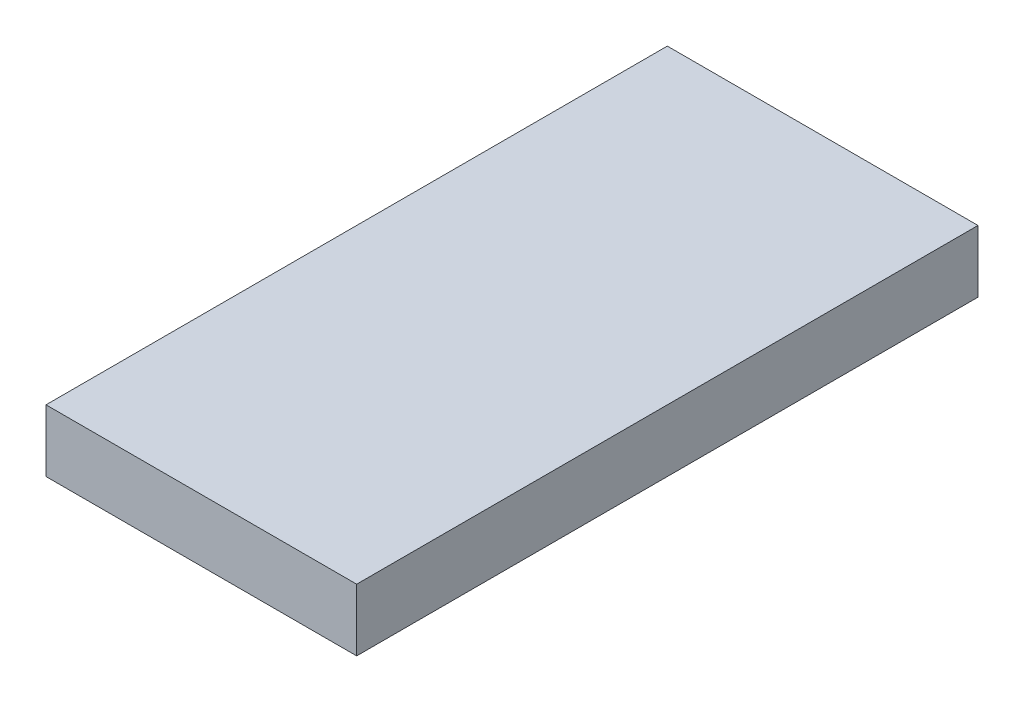
ISO-10303-21;
HEADER;
FILE_DESCRIPTION(('STEP AP214'),'2;1');
FILE_NAME('part.step','',(''),(''),'','','');
FILE_SCHEMA(('AUTOMOTIVE_DESIGN { 1 0 10303 214 1 1 1 1 }'));
ENDSEC;
DATA;
#1=APPLICATION_CONTEXT('core data for automotive mechanical design processes');
#2=APPLICATION_PROTOCOL_DEFINITION('international standard','automotive_design',2000,#1);
#3=PRODUCT_CONTEXT('',#1,'mechanical');
#4=PRODUCT('Part','Part','',(#3));
#5=PRODUCT_RELATED_PRODUCT_CATEGORY('part','',(#4));
#6=PRODUCT_DEFINITION_FORMATION('','',#4);
#7=PRODUCT_DEFINITION_CONTEXT('part definition',#1,'design');
#8=PRODUCT_DEFINITION('design','',#6,#7);
#9=PRODUCT_DEFINITION_SHAPE('','',#8);
#10=(LENGTH_UNIT() NAMED_UNIT(*) SI_UNIT(.MILLI.,.METRE.));
#11=(NAMED_UNIT(*) PLANE_ANGLE_UNIT() SI_UNIT($,.RADIAN.));
#12=(NAMED_UNIT(*) SI_UNIT($,.STERADIAN.) SOLID_ANGLE_UNIT());
#13=UNCERTAINTY_MEASURE_WITH_UNIT(LENGTH_MEASURE(1.E-05),#10,'distance_accuracy_value','');
#14=(GEOMETRIC_REPRESENTATION_CONTEXT(3) GLOBAL_UNCERTAINTY_ASSIGNED_CONTEXT((#13)) GLOBAL_UNIT_ASSIGNED_CONTEXT((#10,
#11,#12)) REPRESENTATION_CONTEXT('',''));
#15=CARTESIAN_POINT('',(0.,0.,0.));
#16=DIRECTION('',(0.,0.,1.));
#17=DIRECTION('',(1.,0.,0.));
#18=AXIS2_PLACEMENT_3D('',#15,#16,#17);
#19=CARTESIAN_POINT('',(-0.486903462864793,0.875068692947304,10.));
#20=DIRECTION('',(1.,0.,0.));
#21=DIRECTION('',(0.,1.,0.));
#22=AXIS2_PLACEMENT_3D('',#19,#20,#21);
#23=PLANE('',#22);
#24=DIRECTION('',(0.,-1.,0.));
#25=VECTOR('',#24,1.);
#26=CARTESIAN_POINT('',(-0.486903462864793,0.875068692947304,0.));
#27=LINE('',#26,#25);
#28=CARTESIAN_POINT('',(-0.486903462864793,0.875068692947304,0.));
#29=VERTEX_POINT('',#28);
#30=CARTESIAN_POINT('',(-0.486903462864793,-0.124931307052696,0.));
#31=VERTEX_POINT('',#30);
#32=EDGE_CURVE('E96',#29,#31,#27,.T.);
#33=ORIENTED_EDGE('',*,*,#32,.T.);
#34=DIRECTION('',(0.,0.,-1.));
#35=VECTOR('',#34,1.);
#36=CARTESIAN_POINT('',(-0.486903462864793,-0.124931307052696,10.));
#37=LINE('',#36,#35);
#38=CARTESIAN_POINT('',(-0.486903462864793,-0.124931307052696,10.));
#39=VERTEX_POINT('',#38);
#40=EDGE_CURVE('E11',#39,#31,#37,.T.);
#41=ORIENTED_EDGE('',*,*,#40,.F.);
#42=DIRECTION('',(0.,-1.,0.));
#43=VECTOR('',#42,1.);
#44=CARTESIAN_POINT('',(-0.486903462864793,0.875068692947304,10.));
#45=LINE('',#44,#43);
#46=CARTESIAN_POINT('',(-0.486903462864793,0.875068692947304,10.));
#47=VERTEX_POINT('',#46);
#48=EDGE_CURVE('E84',#47,#39,#45,.T.);
#49=ORIENTED_EDGE('',*,*,#48,.F.);
#50=DIRECTION('',(0.,0.,-1.));
#51=VECTOR('',#50,1.);
#52=CARTESIAN_POINT('',(-0.486903462864793,0.875068692947304,10.));
#53=LINE('',#52,#51);
#54=EDGE_CURVE('E92',#47,#29,#53,.T.);
#55=ORIENTED_EDGE('',*,*,#54,.T.);
#56=EDGE_LOOP('',(#33,#41,#49,#55));
#57=FACE_BOUND('',#56,.T.);
#58=ADVANCED_FACE('F33',(#57),#23,.F.);
#59=CARTESIAN_POINT('',(-0.486903462864793,-0.124931307052696,10.));
#60=DIRECTION('',(0.,1.,0.));
#61=DIRECTION('',(0.,0.,1.));
#62=AXIS2_PLACEMENT_3D('',#59,#60,#61);
#63=PLANE('',#62);
#64=DIRECTION('',(1.,0.,0.));
#65=VECTOR('',#64,1.);
#66=CARTESIAN_POINT('',(-0.486903462864793,-0.124931307052696,0.));
#67=LINE('',#66,#65);
#68=CARTESIAN_POINT('',(4.51309653713521,-0.124931307052696,0.));
#69=VERTEX_POINT('',#68);
#70=EDGE_CURVE('E88',#31,#69,#67,.T.);
#71=ORIENTED_EDGE('',*,*,#70,.T.);
#72=DIRECTION('',(0.,0.,-1.));
#73=VECTOR('',#72,1.);
#74=CARTESIAN_POINT('',(4.51309653713521,-0.124931307052696,10.));
#75=LINE('',#74,#73);
#76=CARTESIAN_POINT('',(4.51309653713521,-0.124931307052696,10.));
#77=VERTEX_POINT('',#76);
#78=EDGE_CURVE('E41',#77,#69,#75,.T.);
#79=ORIENTED_EDGE('',*,*,#78,.F.);
#80=DIRECTION('',(1.,0.,0.));
#81=VECTOR('',#80,1.);
#82=CARTESIAN_POINT('',(-0.486903462864793,-0.124931307052696,10.));
#83=LINE('',#82,#81);
#84=EDGE_CURVE('E79',#39,#77,#83,.T.);
#85=ORIENTED_EDGE('',*,*,#84,.F.);
#86=ORIENTED_EDGE('',*,*,#40,.T.);
#87=EDGE_LOOP('',(#71,#79,#85,#86));
#88=FACE_BOUND('',#87,.T.);
#89=ADVANCED_FACE('F87',(#88),#63,.F.);
#90=CARTESIAN_POINT('',(4.51309653713521,0.875068692947304,10.));
#91=DIRECTION('',(-1.,0.,0.));
#92=DIRECTION('',(0.,0.,1.));
#93=AXIS2_PLACEMENT_3D('',#90,#91,#92);
#94=PLANE('',#93);
#95=DIRECTION('',(0.,1.,0.));
#96=VECTOR('',#95,1.);
#97=CARTESIAN_POINT('',(4.51309653713521,0.875068692947304,0.));
#98=LINE('',#97,#96);
#99=CARTESIAN_POINT('',(4.51309653713521,0.875068692947304,0.));
#100=VERTEX_POINT('',#99);
#101=EDGE_CURVE('E66',#69,#100,#98,.T.);
#102=ORIENTED_EDGE('',*,*,#101,.T.);
#103=DIRECTION('',(0.,0.,-1.));
#104=VECTOR('',#103,1.);
#105=CARTESIAN_POINT('',(4.51309653713521,0.875068692947304,10.));
#106=LINE('',#105,#104);
#107=CARTESIAN_POINT('',(4.51309653713521,0.875068692947304,10.));
#108=VERTEX_POINT('',#107);
#109=EDGE_CURVE('E89',#108,#100,#106,.T.);
#110=ORIENTED_EDGE('',*,*,#109,.F.);
#111=DIRECTION('',(0.,1.,0.));
#112=VECTOR('',#111,1.);
#113=CARTESIAN_POINT('',(4.51309653713521,0.875068692947304,10.));
#114=LINE('',#113,#112);
#115=EDGE_CURVE('E82',#77,#108,#114,.T.);
#116=ORIENTED_EDGE('',*,*,#115,.F.);
#117=ORIENTED_EDGE('',*,*,#78,.T.);
#118=EDGE_LOOP('',(#102,#110,#116,#117));
#119=FACE_BOUND('',#118,.T.);
#120=ADVANCED_FACE('F90',(#119),#94,.F.);
#121=CARTESIAN_POINT('',(-0.486903462864793,0.875068692947304,10.));
#122=DIRECTION('',(0.,-1.,0.));
#123=DIRECTION('',(0.,0.,-1.));
#124=AXIS2_PLACEMENT_3D('',#121,#122,#123);
#125=PLANE('',#124);
#126=DIRECTION('',(-1.,0.,0.));
#127=VECTOR('',#126,1.);
#128=CARTESIAN_POINT('',(-0.486903462864793,0.875068692947304,0.));
#129=LINE('',#128,#127);
#130=EDGE_CURVE('E72',#100,#29,#129,.T.);
#131=ORIENTED_EDGE('',*,*,#130,.T.);
#132=ORIENTED_EDGE('',*,*,#54,.F.);
#133=DIRECTION('',(-1.,0.,0.));
#134=VECTOR('',#133,1.);
#135=CARTESIAN_POINT('',(-0.486903462864793,0.875068692947304,10.));
#136=LINE('',#135,#134);
#137=EDGE_CURVE('E49',#108,#47,#136,.T.);
#138=ORIENTED_EDGE('',*,*,#137,.F.);
#139=ORIENTED_EDGE('',*,*,#109,.T.);
#140=EDGE_LOOP('',(#131,#132,#138,#139));
#141=FACE_BOUND('',#140,.T.);
#142=ADVANCED_FACE('F103',(#141),#125,.F.);
#143=CARTESIAN_POINT('',(0.,0.,10.));
#144=DIRECTION('',(0.,0.,1.));
#145=DIRECTION('',(1.,0.,0.));
#146=AXIS2_PLACEMENT_3D('',#143,#144,#145);
#147=PLANE('',#146);
#148=ORIENTED_EDGE('',*,*,#48,.T.);
#149=ORIENTED_EDGE('',*,*,#84,.T.);
#150=ORIENTED_EDGE('',*,*,#115,.T.);
#151=ORIENTED_EDGE('',*,*,#137,.T.);
#152=EDGE_LOOP('',(#148,#149,#150,#151));
#153=FACE_BOUND('',#152,.T.);
#154=ADVANCED_FACE('F80',(#153),#147,.T.);
#155=CARTESIAN_POINT('',(0.,0.,0.));
#156=DIRECTION('',(0.,0.,1.));
#157=DIRECTION('',(1.,0.,0.));
#158=AXIS2_PLACEMENT_3D('',#155,#156,#157);
#159=PLANE('',#158);
#160=ORIENTED_EDGE('',*,*,#32,.F.);
#161=ORIENTED_EDGE('',*,*,#130,.F.);
#162=ORIENTED_EDGE('',*,*,#101,.F.);
#163=ORIENTED_EDGE('',*,*,#70,.F.);
#164=EDGE_LOOP('',(#160,#161,#162,#163));
#165=FACE_BOUND('',#164,.T.);
#166=ADVANCED_FACE('F106',(#165),#159,.F.);
#167=CLOSED_SHELL('',(#58,#89,#120,#142,#154,#166));
#168=MANIFOLD_SOLID_BREP('B2',#167);
#169=ADVANCED_BREP_SHAPE_REPRESENTATION('',(#18,#168),#14);
#170=SHAPE_DEFINITION_REPRESENTATION(#9,#169);
ENDSEC;
END-ISO-10303-21;
